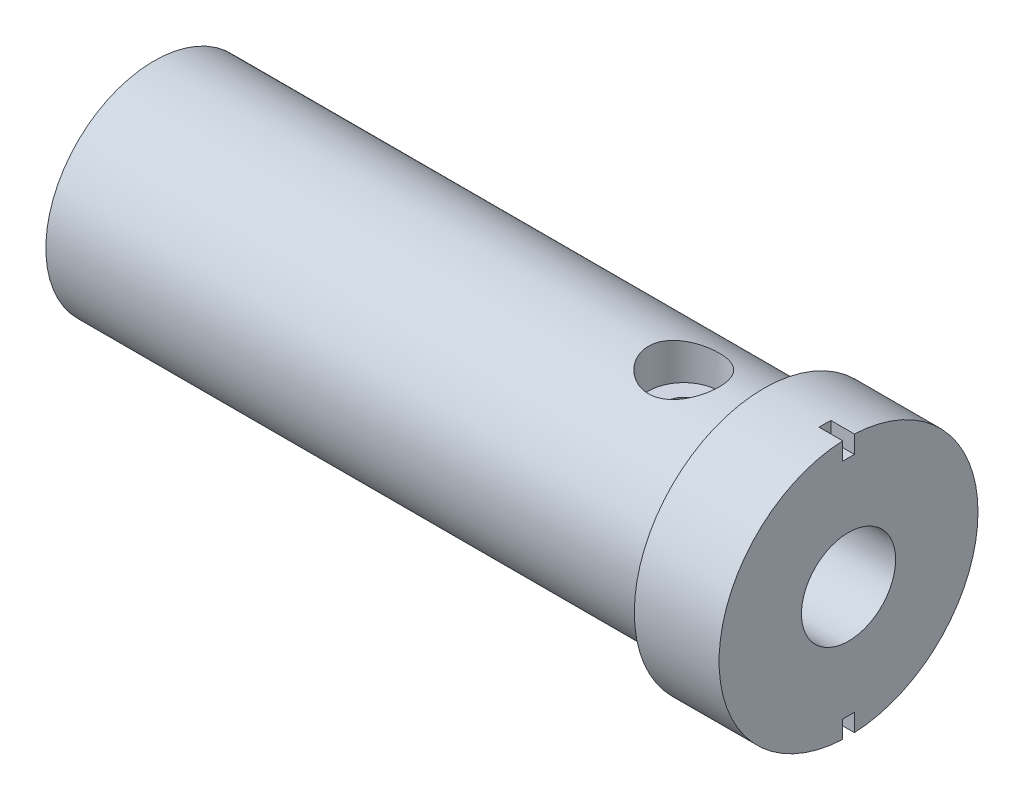
ISO-10303-21;
HEADER;
FILE_DESCRIPTION(('STEP AP214'),'2;1');
FILE_NAME('part.step','',(''),(''),'','','');
FILE_SCHEMA(('AUTOMOTIVE_DESIGN { 1 0 10303 214 1 1 1 1 }'));
ENDSEC;
DATA;
#1=APPLICATION_CONTEXT('core data for automotive mechanical design processes');
#2=APPLICATION_PROTOCOL_DEFINITION('international standard','automotive_design',2000,#1);
#3=PRODUCT_CONTEXT('',#1,'mechanical');
#4=PRODUCT('Part','Part','',(#3));
#5=PRODUCT_RELATED_PRODUCT_CATEGORY('part','',(#4));
#6=PRODUCT_DEFINITION_FORMATION('','',#4);
#7=PRODUCT_DEFINITION_CONTEXT('part definition',#1,'design');
#8=PRODUCT_DEFINITION('design','',#6,#7);
#9=PRODUCT_DEFINITION_SHAPE('','',#8);
#10=(LENGTH_UNIT() NAMED_UNIT(*) SI_UNIT(.MILLI.,.METRE.));
#11=(NAMED_UNIT(*) PLANE_ANGLE_UNIT() SI_UNIT($,.RADIAN.));
#12=(NAMED_UNIT(*) SI_UNIT($,.STERADIAN.) SOLID_ANGLE_UNIT());
#13=UNCERTAINTY_MEASURE_WITH_UNIT(LENGTH_MEASURE(1.E-05),#10,'distance_accuracy_value','');
#14=(GEOMETRIC_REPRESENTATION_CONTEXT(3) GLOBAL_UNCERTAINTY_ASSIGNED_CONTEXT((#13)) GLOBAL_UNIT_ASSIGNED_CONTEXT((#10,
#11,#12)) REPRESENTATION_CONTEXT('',''));
#15=CARTESIAN_POINT('',(0.,0.,0.));
#16=DIRECTION('',(0.,0.,1.));
#17=DIRECTION('',(1.,0.,0.));
#18=AXIS2_PLACEMENT_3D('',#15,#16,#17);
#19=CARTESIAN_POINT('',(0.,0.,0.));
#20=DIRECTION('',(1.,0.,0.));
#21=DIRECTION('',(0.,0.,-1.));
#22=AXIS2_PLACEMENT_3D('',#19,#20,#21);
#23=PLANE('',#22);
#24=CARTESIAN_POINT('',(0.,0.,0.));
#25=DIRECTION('',(1.,0.,0.));
#26=DIRECTION('',(0.,0.,-1.));
#27=AXIS2_PLACEMENT_3D('',#24,#25,#26);
#28=CIRCLE('',#27,4.);
#29=CARTESIAN_POINT('',(0.,0.,-4.));
#30=VERTEX_POINT('',#29);
#31=EDGE_CURVE('E209',#30,#30,#28,.T.);
#32=ORIENTED_EDGE('',*,*,#31,.F.);
#33=EDGE_LOOP('',(#32));
#34=FACE_BOUND('',#33,.T.);
#35=DIRECTION('',(0.,0.,1.));
#36=VECTOR('',#35,1.);
#37=CARTESIAN_POINT('',(0.,9.48863048791795,0.));
#38=LINE('',#37,#36);
#39=CARTESIAN_POINT('',(0.,9.48863048791795,-0.499999999999999));
#40=VERTEX_POINT('',#39);
#41=CARTESIAN_POINT('',(0.,9.48863048791795,0.500000000000001));
#42=VERTEX_POINT('',#41);
#43=EDGE_CURVE('E140',#40,#42,#38,.T.);
#44=ORIENTED_EDGE('',*,*,#43,.T.);
#45=DIRECTION('',(0.,1.,0.));
#46=VECTOR('',#45,1.);
#47=CARTESIAN_POINT('',(0.,0.,0.500000000000001));
#48=LINE('',#47,#46);
#49=CARTESIAN_POINT('',(0.,10.988630487918,0.500000000000001));
#50=VERTEX_POINT('',#49);
#51=EDGE_CURVE('E127',#42,#50,#48,.T.);
#52=ORIENTED_EDGE('',*,*,#51,.T.);
#53=CARTESIAN_POINT('',(0.,0.,0.));
#54=DIRECTION('',(1.,0.,0.));
#55=DIRECTION('',(0.,0.,-1.));
#56=AXIS2_PLACEMENT_3D('',#53,#54,#55);
#57=CIRCLE('',#56,11.);
#58=CARTESIAN_POINT('',(0.,-10.988630487918,0.500000000000001));
#59=VERTEX_POINT('',#58);
#60=EDGE_CURVE('E11',#50,#59,#57,.T.);
#61=ORIENTED_EDGE('',*,*,#60,.T.);
#62=DIRECTION('',(0.,-1.,0.));
#63=VECTOR('',#62,1.);
#64=CARTESIAN_POINT('',(0.,0.,0.500000000000001));
#65=LINE('',#64,#63);
#66=CARTESIAN_POINT('',(0.,-9.48863048791795,0.500000000000001));
#67=VERTEX_POINT('',#66);
#68=EDGE_CURVE('E166',#67,#59,#65,.T.);
#69=ORIENTED_EDGE('',*,*,#68,.F.);
#70=DIRECTION('',(0.,0.,1.));
#71=VECTOR('',#70,1.);
#72=CARTESIAN_POINT('',(0.,-9.48863048791795,0.));
#73=LINE('',#72,#71);
#74=CARTESIAN_POINT('',(0.,-9.48863048791795,-0.499999999999999));
#75=VERTEX_POINT('',#74);
#76=EDGE_CURVE('E180',#75,#67,#73,.T.);
#77=ORIENTED_EDGE('',*,*,#76,.F.);
#78=DIRECTION('',(0.,1.,0.));
#79=VECTOR('',#78,1.);
#80=CARTESIAN_POINT('',(0.,0.,-0.5));
#81=LINE('',#80,#79);
#82=CARTESIAN_POINT('',(0.,-10.988630487918,-0.499999999999999));
#83=VERTEX_POINT('',#82);
#84=EDGE_CURVE('E176',#83,#75,#81,.T.);
#85=ORIENTED_EDGE('',*,*,#84,.F.);
#86=CARTESIAN_POINT('',(0.,10.988630487918,-0.499999999999999));
#87=VERTEX_POINT('',#86);
#88=EDGE_CURVE('E53',#83,#87,#57,.T.);
#89=ORIENTED_EDGE('',*,*,#88,.T.);
#90=DIRECTION('',(0.,-1.,0.));
#91=VECTOR('',#90,1.);
#92=CARTESIAN_POINT('',(0.,0.,-0.5));
#93=LINE('',#92,#91);
#94=EDGE_CURVE('E136',#87,#40,#93,.T.);
#95=ORIENTED_EDGE('',*,*,#94,.T.);
#96=EDGE_LOOP('',(#44,#52,#61,#69,#77,#85,#89,#95));
#97=FACE_BOUND('',#96,.T.);
#98=ADVANCED_FACE('F39',(#34,#97),#23,.T.);
#99=CARTESIAN_POINT('',(0.,0.,0.));
#100=DIRECTION('',(1.,0.,0.));
#101=DIRECTION('',(0.,0.,-1.));
#102=AXIS2_PLACEMENT_3D('',#99,#100,#101);
#103=CYLINDRICAL_SURFACE('',#102,11.);
#104=CARTESIAN_POINT('',(-7.2,0.,0.));
#105=DIRECTION('',(1.,0.,0.));
#106=DIRECTION('',(0.,0.,-1.));
#107=AXIS2_PLACEMENT_3D('',#104,#105,#106);
#108=CIRCLE('',#107,11.);
#109=CARTESIAN_POINT('',(-7.2,0.,-11.));
#110=VERTEX_POINT('',#109);
#111=EDGE_CURVE('E221',#110,#110,#108,.T.);
#112=ORIENTED_EDGE('',*,*,#111,.T.);
#113=EDGE_LOOP('',(#112));
#114=FACE_BOUND('',#113,.T.);
#115=ORIENTED_EDGE('',*,*,#60,.F.);
#116=DIRECTION('',(1.,0.,0.));
#117=VECTOR('',#116,1.);
#118=CARTESIAN_POINT('',(-2.,10.988630487918,0.500000000000001));
#119=LINE('',#118,#117);
#120=CARTESIAN_POINT('',(-2.,10.988630487918,0.500000000000001));
#121=VERTEX_POINT('',#120);
#122=EDGE_CURVE('E152',#121,#50,#119,.T.);
#123=ORIENTED_EDGE('',*,*,#122,.F.);
#124=CARTESIAN_POINT('',(-2.,0.,0.));
#125=DIRECTION('',(1.,0.,0.));
#126=DIRECTION('',(0.,0.,-1.));
#127=AXIS2_PLACEMENT_3D('',#124,#125,#126);
#128=CIRCLE('',#127,11.);
#129=CARTESIAN_POINT('',(-2.,10.988630487918,-0.499999999999999));
#130=VERTEX_POINT('',#129);
#131=EDGE_CURVE('E130',#130,#121,#128,.T.);
#132=ORIENTED_EDGE('',*,*,#131,.F.);
#133=DIRECTION('',(1.,0.,0.));
#134=VECTOR('',#133,1.);
#135=CARTESIAN_POINT('',(-2.,10.988630487918,-0.499999999999999));
#136=LINE('',#135,#134);
#137=EDGE_CURVE('E156',#130,#87,#136,.T.);
#138=ORIENTED_EDGE('',*,*,#137,.T.);
#139=ORIENTED_EDGE('',*,*,#88,.F.);
#140=DIRECTION('',(1.,0.,0.));
#141=VECTOR('',#140,1.);
#142=CARTESIAN_POINT('',(-2.,-10.988630487918,-0.499999999999999));
#143=LINE('',#142,#141);
#144=CARTESIAN_POINT('',(-2.,-10.988630487918,-0.499999999999999));
#145=VERTEX_POINT('',#144);
#146=EDGE_CURVE('E175',#145,#83,#143,.T.);
#147=ORIENTED_EDGE('',*,*,#146,.F.);
#148=CARTESIAN_POINT('',(-2.,0.,0.));
#149=DIRECTION('',(1.,0.,0.));
#150=DIRECTION('',(0.,0.,-1.));
#151=AXIS2_PLACEMENT_3D('',#148,#149,#150);
#152=CIRCLE('',#151,11.);
#153=CARTESIAN_POINT('',(-2.,-10.988630487918,0.500000000000001));
#154=VERTEX_POINT('',#153);
#155=EDGE_CURVE('E162',#154,#145,#152,.T.);
#156=ORIENTED_EDGE('',*,*,#155,.F.);
#157=DIRECTION('',(1.,0.,0.));
#158=VECTOR('',#157,1.);
#159=CARTESIAN_POINT('',(-2.,-10.988630487918,0.500000000000001));
#160=LINE('',#159,#158);
#161=EDGE_CURVE('E149',#154,#59,#160,.T.);
#162=ORIENTED_EDGE('',*,*,#161,.T.);
#163=EDGE_LOOP('',(#115,#123,#132,#138,#139,#147,#156,#162));
#164=FACE_BOUND('',#163,.T.);
#165=ADVANCED_FACE('F258',(#114,#164),#103,.T.);
#166=CARTESIAN_POINT('',(0.,0.,0.));
#167=DIRECTION('',(1.,0.,0.));
#168=DIRECTION('',(0.,0.,-1.));
#169=AXIS2_PLACEMENT_3D('',#166,#167,#168);
#170=CYLINDRICAL_SURFACE('',#169,9.19999999999999);
#171=CARTESIAN_POINT('',(-59.,0.,0.));
#172=DIRECTION('',(1.,0.,0.));
#173=DIRECTION('',(0.,0.,-1.));
#174=AXIS2_PLACEMENT_3D('',#171,#172,#173);
#175=CIRCLE('',#174,9.19999999999999);
#176=CARTESIAN_POINT('',(-59.,0.,-9.19999999999999));
#177=VERTEX_POINT('',#176);
#178=EDGE_CURVE('E208',#177,#177,#175,.T.);
#179=ORIENTED_EDGE('',*,*,#178,.T.);
#180=EDGE_LOOP('',(#179));
#181=FACE_BOUND('',#180,.T.);
#182=CARTESIAN_POINT('',(-7.2,0.,0.));
#183=DIRECTION('',(1.,0.,0.));
#184=DIRECTION('',(0.,0.,-1.));
#185=AXIS2_PLACEMENT_3D('',#182,#183,#184);
#186=CIRCLE('',#185,9.2);
#187=CARTESIAN_POINT('',(-7.2,0.,-9.2));
#188=VERTEX_POINT('',#187);
#189=EDGE_CURVE('E217',#188,#188,#186,.T.);
#190=ORIENTED_EDGE('',*,*,#189,.F.);
#191=EDGE_LOOP('',(#190));
#192=FACE_BOUND('',#191,.T.);
#193=CARTESIAN_POINT('',(-14.,8.69712596206355,-3.));
#194=CARTESIAN_POINT('',(-13.8363719641745,8.69712602561283,-3.00000006948843));
#195=CARTESIAN_POINT('',(-13.6727429048873,8.70179420906425,-2.98656760005086));
#196=CARTESIAN_POINT('',(-13.3503181658293,8.7198707417757,-2.93336401551207));
#197=CARTESIAN_POINT('',(-13.1915234649716,8.73328084903519,-2.89358760262237));
#198=CARTESIAN_POINT('',(-12.8834880523258,8.76716430876784,-2.78923030719512));
#199=CARTESIAN_POINT('',(-12.7342298865561,8.78762429226838,-2.72469634734532));
#200=CARTESIAN_POINT('',(-12.4486127853286,8.83328304536185,-2.57281482250125));
#201=CARTESIAN_POINT('',(-12.3122565089369,8.85848278863063,-2.48546256857121));
#202=CARTESIAN_POINT('',(-12.0512103195749,8.91183948555475,-2.28692219691646));
#203=CARTESIAN_POINT('',(-11.9270739443255,8.94006780908053,-2.17502527730267));
#204=CARTESIAN_POINT('',(-11.6989534102711,8.99569637021582,-1.93208603100607));
#205=CARTESIAN_POINT('',(-11.5949723333283,9.02309648064696,-1.80104078179666));
#206=CARTESIAN_POINT('',(-11.4076269513869,9.07480417137145,-1.51950174610697));
#207=CARTESIAN_POINT('',(-11.3248391108413,9.09901799471419,-1.36860562348148));
#208=CARTESIAN_POINT('',(-11.1860378336906,9.14078660779368,-1.05410527392676));
#209=CARTESIAN_POINT('',(-11.1300175104857,9.15834311004923,-0.890504328230099));
#210=CARTESIAN_POINT('',(-11.0482083321482,9.18431353905578,-0.561039311526711));
#211=CARTESIAN_POINT('',(-11.021471989602,9.19301331783793,-0.395433460298393));
#212=CARTESIAN_POINT('',(-10.9959808228424,9.2013029471673,-0.0618729536399165));
#213=CARTESIAN_POINT('',(-10.9972190892016,9.20089504721341,0.106081111564884));
#214=CARTESIAN_POINT('',(-11.0270330949521,9.19121087856134,0.432877467383254));
#215=CARTESIAN_POINT('',(-11.0545804301941,9.18226823639605,0.591825072105989));
#216=CARTESIAN_POINT('',(-11.1345346363526,9.15693522813862,0.902703713535023));
#217=CARTESIAN_POINT('',(-11.1869431720646,9.1405443632898,1.0546342796074));
#218=CARTESIAN_POINT('',(-11.3157536765466,9.10172363407732,1.34945857551705));
#219=CARTESIAN_POINT('',(-11.3924551290893,9.07921891922917,1.49221119656913));
#220=CARTESIAN_POINT('',(-11.5674297774354,9.03052321490297,1.76312900882243));
#221=CARTESIAN_POINT('',(-11.6657087859708,9.00433123280328,1.89129025512961));
#222=CARTESIAN_POINT('',(-11.8862660672858,8.94963510368291,2.13551054636341));
#223=CARTESIAN_POINT('',(-12.0094279326935,8.92107995667196,2.25076133825675));
#224=CARTESIAN_POINT('',(-12.2735830226485,8.86588177281267,2.45922724376976));
#225=CARTESIAN_POINT('',(-12.4145787506148,8.8392390052382,2.55243925842673));
#226=CARTESIAN_POINT('',(-12.7128614559887,8.79061060372585,2.71523620605493));
#227=CARTESIAN_POINT('',(-12.870337954798,8.76869067896904,2.78449500230246));
#228=CARTESIAN_POINT('',(-13.1956103201195,8.73275371918737,2.89524477566101));
#229=CARTESIAN_POINT('',(-13.3634020543878,8.71873354214059,2.93674679389927));
#230=CARTESIAN_POINT('',(-13.6967425583219,8.70088969109624,2.98919004884247));
#231=CARTESIAN_POINT('',(-13.862072827101,8.69665004268403,3.00137901368447));
#232=CARTESIAN_POINT('',(-14.1924368298021,8.69768729156416,2.99837337293999));
#233=CARTESIAN_POINT('',(-14.3574706097813,8.70296255434456,2.98318347061216));
#234=CARTESIAN_POINT('',(-14.6769901426862,8.72202193994362,2.92697036189824));
#235=CARTESIAN_POINT('',(-14.8316444085104,8.73552500390931,2.88679959741978));
#236=CARTESIAN_POINT('',(-15.131991490569,8.76921338217084,2.78278011008459));
#237=CARTESIAN_POINT('',(-15.2776827568995,8.7893998483471,2.71892730541411));
#238=CARTESIAN_POINT('',(-15.5609171482622,8.83494779646293,2.56712739933201));
#239=CARTESIAN_POINT('',(-15.6980733808423,8.8604489949994,2.47850145430636));
#240=CARTESIAN_POINT('',(-15.9560195986291,8.91347559935073,2.28044848294344));
#241=CARTESIAN_POINT('',(-16.076804943858,8.94100157564942,2.17101558034839));
#242=CARTESIAN_POINT('',(-16.3042846156628,8.99649879773837,1.92850982824102));
#243=CARTESIAN_POINT('',(-16.4100821980691,9.02443286130206,1.79458489750842));
#244=CARTESIAN_POINT('',(-16.5977520889612,9.07635176949049,1.51019887066399));
#245=CARTESIAN_POINT('',(-16.6796253470579,9.10033677084598,1.35973843121036));
#246=CARTESIAN_POINT('',(-16.8163567816146,9.1415331876694,1.04737228527324));
#247=CARTESIAN_POINT('',(-16.8713990904744,9.15879060371627,0.885553564855848));
#248=CARTESIAN_POINT('',(-16.9532777416875,9.18478757011083,0.554286640438635));
#249=CARTESIAN_POINT('',(-16.9801237806073,9.19353004863087,0.384841080192691));
#250=CARTESIAN_POINT('',(-17.0040048323584,9.20130058724371,0.0513507308213625));
#251=CARTESIAN_POINT('',(-17.0023298846796,9.20074903984763,-0.112592918733417));
#252=CARTESIAN_POINT('',(-16.9723765689864,9.19101860788011,-0.437754965054961));
#253=CARTESIAN_POINT('',(-16.9441002048655,9.18184037315992,-0.598973566169311));
#254=CARTESIAN_POINT('',(-16.8625910848386,9.1560347195712,-0.911768497880307));
#255=CARTESIAN_POINT('',(-16.8097299077098,9.13951837084227,-1.06345146731181));
#256=CARTESIAN_POINT('',(-16.6808924735539,9.1007374974658,-1.35585956495554));
#257=CARTESIAN_POINT('',(-16.6049121016948,9.07847194966336,-1.4965827369017));
#258=CARTESIAN_POINT('',(-16.428845635717,9.02950168220742,-1.76858430385069));
#259=CARTESIAN_POINT('',(-16.3279916296062,9.00266622521187,-1.8993418037466));
#260=CARTESIAN_POINT('',(-16.1063638529174,8.94791896179727,-2.14250077887531));
#261=CARTESIAN_POINT('',(-15.9855838665481,8.92000682160158,-2.25489650441818));
#262=CARTESIAN_POINT('',(-15.7221861911371,8.86503012273927,-2.46235668401022));
#263=CARTESIAN_POINT('',(-15.5789260098108,8.8380351013346,-2.55662631922266));
#264=CARTESIAN_POINT('',(-15.2777649555458,8.78923590884106,-2.71967131657978));
#265=CARTESIAN_POINT('',(-15.1198686935222,8.76743011062269,-2.78845467396348));
#266=CARTESIAN_POINT('',(-14.8035183632355,8.73283625684646,-2.89491464128439));
#267=CARTESIAN_POINT('',(-14.6456553983462,8.71958920178867,-2.93419731407699));
#268=CARTESIAN_POINT('',(-14.3251943123412,8.70173534997871,-2.98673596114189));
#269=CARTESIAN_POINT('',(-14.1625976614769,8.69712589891445,-2.99999993094914));
#270=CARTESIAN_POINT('',(-14.,8.69712596206355,-3.));
#271=B_SPLINE_CURVE_WITH_KNOTS('',3,(#193,#194,#195,#196,#197,#198,#199,#200,#201,#202,#203,
#204,#205,#206,#207,#208,#209,#210,#211,#212,#213,#214,#215,#216,#217,#218,#219,#220,#221,#222,
#223,#224,#225,#226,#227,#228,#229,#230,#231,#232,#233,#234,#235,#236,#237,#238,#239,#240,#241,
#242,#243,#244,#245,#246,#247,#248,#249,#250,#251,#252,#253,#254,#255,#256,#257,#258,#259,#260,
#261,#262,#263,#264,#265,#266,#267,#268,#269,#270),.UNSPECIFIED.,.T.,.F.,(4,2,2,2,2,2,2,2,2,2,2,
2,2,2,2,2,2,2,2,2,2,2,2,2,2,2,2,2,2,2,2,2,2,2,2,2,2,2,4),(0.,0.490282515204811,
0.980663656572736,1.47011993962961,1.9596768803839,2.46586129965626,2.97212305651692,
3.49096398502884,4.00967135703011,4.51104899920583,5.01230280785483,5.49473204934623,
5.97719360059669,6.46585099045064,6.95464018055548,7.46551015601591,7.97645192433021,
8.49409929484987,9.0115406322624,9.50653342702692,10.0014411979209,10.480323237867,
10.9592878558497,11.4529407663323,11.9467333008874,12.4631024813133,12.9794511630884,
13.4922045912555,14.0047816281003,14.4942383091859,14.9836581222892,15.4659098542283,
15.9482474692103,16.4479124063776,16.9477335068034,17.4660419863822,17.9841877307132,
18.4715326954798,18.9587278758968),.UNSPECIFIED.);
#272=CARTESIAN_POINT('',(-14.,8.69712596206355,-3.));
#273=VERTEX_POINT('',#272);
#274=EDGE_CURVE('E42',#273,#273,#271,.T.);
#275=ORIENTED_EDGE('',*,*,#274,.T.);
#276=EDGE_LOOP('',(#275));
#277=FACE_BOUND('',#276,.T.);
#278=ADVANCED_FACE('F240',(#181,#192,#277),#170,.T.);
#279=CARTESIAN_POINT('',(-14.,11.,0.));
#280=DIRECTION('',(0.,-1.,0.));
#281=DIRECTION('',(0.,0.,-1.));
#282=AXIS2_PLACEMENT_3D('',#279,#280,#281);
#283=CYLINDRICAL_SURFACE('',#282,1.475);
#284=CARTESIAN_POINT('',(-14.,3.71811444148778,-1.475));
#285=CARTESIAN_POINT('',(-13.9202345126051,3.71811213565653,-1.47500252199431));
#286=CARTESIAN_POINT('',(-13.840485972295,3.72070918325006,-1.46850804774699));
#287=CARTESIAN_POINT('',(-13.683386854708,3.73074685662595,-1.44281517636158));
#288=CARTESIAN_POINT('',(-13.6060362700037,3.73818746740454,-1.42361681857595));
#289=CARTESIAN_POINT('',(-13.4560433614095,3.75695727071103,-1.37331103095944));
#290=CARTESIAN_POINT('',(-13.3833905449009,3.76827741450174,-1.34223129429865));
#291=CARTESIAN_POINT('',(-13.2443025361921,3.793516438564,-1.26914262044474));
#292=CARTESIAN_POINT('',(-13.1778691511946,3.80743607068124,-1.22713051991561));
#293=CARTESIAN_POINT('',(-13.0499150861579,3.83705483289747,-1.13120849927479));
#294=CARTESIAN_POINT('',(-12.9887355615843,3.85280512400773,-1.07685917926158));
#295=CARTESIAN_POINT('',(-12.8761200610122,3.88388289544258,-0.958738641596155));
#296=CARTESIAN_POINT('',(-12.8246860763635,3.89921028880911,-0.894965503061199));
#297=CARTESIAN_POINT('',(-12.7313934664519,3.92832092352489,-0.75723295228631));
#298=CARTESIAN_POINT('',(-12.6899035773273,3.9420371588446,-0.683008350957839));
#299=CARTESIAN_POINT('',(-12.6201398477416,3.96576698519546,-0.528038150759536));
#300=CARTESIAN_POINT('',(-12.591861586617,3.97578181449718,-0.44729474372909));
#301=CARTESIAN_POINT('',(-12.5505140879478,3.99061738241784,-0.285164132019118));
#302=CARTESIAN_POINT('',(-12.5368579712354,3.99563792257159,-0.203945233479788));
#303=CARTESIAN_POINT('',(-12.5232642223347,4.00063505418094,-0.0402237373594162));
#304=CARTESIAN_POINT('',(-12.5233222761699,4.00061323177942,0.0422784483807962));
#305=CARTESIAN_POINT('',(-12.5368086481374,3.99565650156055,0.20202631897613));
#306=CARTESIAN_POINT('',(-12.5495968951372,3.99095679770598,0.279334594774485));
#307=CARTESIAN_POINT('',(-12.5871068145997,3.97747878568365,0.430619174443247));
#308=CARTESIAN_POINT('',(-12.6118293285672,3.96870018990811,0.504595242951995));
#309=CARTESIAN_POINT('',(-12.6728148606985,3.94777990511235,0.648376624059889));
#310=CARTESIAN_POINT('',(-12.7092387269631,3.93559166782433,0.718106659508759));
#311=CARTESIAN_POINT('',(-12.7924523568196,3.9090910818338,0.850635690887643));
#312=CARTESIAN_POINT('',(-12.8392454019834,3.89477806116774,0.913432483181793));
#313=CARTESIAN_POINT('',(-12.9449757697818,3.86454977015343,1.03408995883905));
#314=CARTESIAN_POINT('',(-13.004451599598,3.84858966817658,1.09146824284382));
#315=CARTESIAN_POINT('',(-13.1322840941606,3.81752107182053,1.19561420556987));
#316=CARTESIAN_POINT('',(-13.2006428340698,3.8024127776209,1.24237939790252));
#317=CARTESIAN_POINT('',(-13.3461443504252,3.77448142603862,1.32485166443115));
#318=CARTESIAN_POINT('',(-13.4234405002808,3.7617125559201,1.36030797120532));
#319=CARTESIAN_POINT('',(-13.5835007713566,3.74053148462746,1.41752110407297));
#320=CARTESIAN_POINT('',(-13.6662619443922,3.73211695574566,1.43928525095316));
#321=CARTESIAN_POINT('',(-13.8301490650295,3.72114283180293,1.46741718483658));
#322=CARTESIAN_POINT('',(-13.911124396005,3.71829324830066,1.4745485822466));
#323=CARTESIAN_POINT('',(-14.0731471763952,3.71795226813902,1.47540948834896));
#324=CARTESIAN_POINT('',(-14.1541946040334,3.72045959516115,1.46914218936695));
#325=CARTESIAN_POINT('',(-14.3102166390058,3.73025621606116,1.44407511912156));
#326=CARTESIAN_POINT('',(-14.3853000346173,3.73732376577703,1.4258558666314));
#327=CARTESIAN_POINT('',(-14.5313130250406,3.7551844594644,1.37812710408421));
#328=CARTESIAN_POINT('',(-14.6022417826792,3.76597835130609,1.34861532750884));
#329=CARTESIAN_POINT('',(-14.740822315664,3.79056283087991,1.27791979752024));
#330=CARTESIAN_POINT('',(-14.8082586233717,3.80444877314845,1.23634780256965));
#331=CARTESIAN_POINT('',(-14.9354701400384,3.83348877536074,1.14312903123162));
#332=CARTESIAN_POINT('',(-14.9952426136907,3.84864328489808,1.09147867426079));
#333=CARTESIAN_POINT('',(-15.1092055986854,3.87962892056577,0.975843370136464));
#334=CARTESIAN_POINT('',(-15.1628340987776,3.89544501244442,0.911298626974176));
#335=CARTESIAN_POINT('',(-15.2585612451219,3.92508280935524,0.773736858886338));
#336=CARTESIAN_POINT('',(-15.3006599417041,3.93890452309318,0.700719870945945));
#337=CARTESIAN_POINT('',(-15.3718324865705,3.96297599932408,0.548393561678376));
#338=CARTESIAN_POINT('',(-15.4009590446393,3.97324017872539,0.469111274804157));
#339=CARTESIAN_POINT('',(-15.4453056437974,3.98909130667972,0.306309469162703));
#340=CARTESIAN_POINT('',(-15.460531977424,3.99468037152937,0.222791885777731));
#341=CARTESIAN_POINT('',(-15.4759842948138,4.00035729797106,0.0589788612318041));
#342=CARTESIAN_POINT('',(-15.4770099163648,4.00073840144692,-0.0212316827022015));
#343=CARTESIAN_POINT('',(-15.4660753764268,3.99671438308603,-0.180632033098355));
#344=CARTESIAN_POINT('',(-15.4541166946628,3.99230980663778,-0.259821954832678));
#345=CARTESIAN_POINT('',(-15.4181108290431,3.9793393706644,-0.413091274619788));
#346=CARTESIAN_POINT('',(-15.3943475155363,3.97087138101943,-0.487246266064744));
#347=CARTESIAN_POINT('',(-15.3356861414604,3.95065522499206,-0.630526623625091));
#348=CARTESIAN_POINT('',(-15.3007859774803,3.9389064390198,-0.69965103658663));
#349=CARTESIAN_POINT('',(-15.2191954349324,3.91270511990517,-0.834038593944479));
#350=CARTESIAN_POINT('',(-15.1720769563989,3.898160826978,-0.899023617903026));
#351=CARTESIAN_POINT('',(-15.068070179934,3.86816128804962,-1.02041401083609));
#352=CARTESIAN_POINT('',(-15.0111784436397,3.85270572271171,-1.07681634709181));
#353=CARTESIAN_POINT('',(-14.8858134556283,3.82167177537087,-1.18237328477067));
#354=CARTESIAN_POINT('',(-14.8168997708888,3.80612676839609,-1.2310165810729));
#355=CARTESIAN_POINT('',(-14.6713838054388,3.77757206560537,-1.31604289925926));
#356=CARTESIAN_POINT('',(-14.5947812095536,3.76456247378251,-1.35242541829754));
#357=CARTESIAN_POINT('',(-14.4335457600886,3.74243106136043,-1.41254286309879));
#358=CARTESIAN_POINT('',(-14.3487420822731,3.73343604397724,-1.43587050505717));
#359=CARTESIAN_POINT('',(-14.1759507711393,3.72128075575353,-1.46709305335709));
#360=CARTESIAN_POINT('',(-14.08796508039,3.71811698434984,-1.47499721875413));
#361=CARTESIAN_POINT('',(-14.,3.71811444148778,-1.475));
#362=B_SPLINE_CURVE_WITH_KNOTS('',3,(#284,#285,#286,#287,#288,#289,#290,#291,#292,#293,#294,
#295,#296,#297,#298,#299,#300,#301,#302,#303,#304,#305,#306,#307,#308,#309,#310,#311,#312,#313,
#314,#315,#316,#317,#318,#319,#320,#321,#322,#323,#324,#325,#326,#327,#328,#329,#330,#331,#332,
#333,#334,#335,#336,#337,#338,#339,#340,#341,#342,#343,#344,#345,#346,#347,#348,#349,#350,#351,
#352,#353,#354,#355,#356,#357,#358,#359,#360,#361),.UNSPECIFIED.,.T.,.F.,(4,2,2,2,2,2,2,2,2,2,2,
2,2,2,2,2,2,2,2,2,2,2,2,2,2,2,2,2,2,2,2,2,2,2,2,2,2,2,4),(0.,0.238969181810635,
0.477937623376773,0.71635243911806,0.954836318278162,1.20373311013185,1.45268070546066,
1.70978089132938,1.9667949887284,2.21305487306768,2.45923729315766,2.6936367359991,
2.92805270914773,3.16583975457612,3.40370216108591,3.65506393313976,3.90648453247798,
4.16314485027735,4.41966782262403,4.6624236250086,4.90512159570665,5.13682652071959,
5.36857797555689,5.60882566745091,5.84915886910428,6.10413555547834,6.35911112880641,
6.61304098887209,6.86685583952638,7.10631630708974,7.34574948797949,7.57968501432373,
7.81366475012415,8.05732605723101,8.30107326386441,8.5571570789309,8.81325139537211,
9.07694406229741,9.34047837989814),.UNSPECIFIED.);
#363=CARTESIAN_POINT('',(-14.,3.71811444148778,-1.475));
#364=VERTEX_POINT('',#363);
#365=EDGE_CURVE('E213',#364,#364,#362,.T.);
#366=ORIENTED_EDGE('',*,*,#365,.T.);
#367=EDGE_LOOP('',(#366));
#368=FACE_BOUND('',#367,.T.);
#369=CARTESIAN_POINT('',(-14.,5.9,0.));
#370=DIRECTION('',(0.,1.,0.));
#371=DIRECTION('',(0.,0.,1.));
#372=AXIS2_PLACEMENT_3D('',#369,#370,#371);
#373=CIRCLE('',#372,1.475);
#374=CARTESIAN_POINT('',(-14.,5.9,1.475));
#375=VERTEX_POINT('',#374);
#376=EDGE_CURVE('E155',#375,#375,#373,.T.);
#377=ORIENTED_EDGE('',*,*,#376,.T.);
#378=EDGE_LOOP('',(#377));
#379=FACE_BOUND('',#378,.T.);
#380=ADVANCED_FACE('F237',(#368,#379),#283,.F.);
#381=CARTESIAN_POINT('',(-20.,0.,0.));
#382=DIRECTION('',(1.,0.,0.));
#383=DIRECTION('',(0.,0.,-1.));
#384=AXIS2_PLACEMENT_3D('',#381,#382,#383);
#385=CYLINDRICAL_SURFACE('',#384,4.);
#386=CARTESIAN_POINT('',(-20.,0.,0.));
#387=DIRECTION('',(1.,0.,0.));
#388=DIRECTION('',(0.,0.,-1.));
#389=AXIS2_PLACEMENT_3D('',#386,#387,#388);
#390=CIRCLE('',#389,4.);
#391=CARTESIAN_POINT('',(-20.,0.,-4.));
#392=VERTEX_POINT('',#391);
#393=EDGE_CURVE('E204',#392,#392,#390,.T.);
#394=ORIENTED_EDGE('',*,*,#393,.F.);
#395=EDGE_LOOP('',(#394));
#396=FACE_BOUND('',#395,.T.);
#397=ORIENTED_EDGE('',*,*,#31,.T.);
#398=EDGE_LOOP('',(#397));
#399=FACE_BOUND('',#398,.T.);
#400=ORIENTED_EDGE('',*,*,#365,.F.);
#401=EDGE_LOOP('',(#400));
#402=FACE_BOUND('',#401,.T.);
#403=ADVANCED_FACE('F233',(#396,#399,#402),#385,.F.);
#404=CARTESIAN_POINT('',(-7.2,0.,-11.));
#405=DIRECTION('',(-1.,0.,0.));
#406=DIRECTION('',(0.,0.,1.));
#407=AXIS2_PLACEMENT_3D('',#404,#405,#406);
#408=PLANE('',#407);
#409=ORIENTED_EDGE('',*,*,#189,.T.);
#410=EDGE_LOOP('',(#409));
#411=FACE_BOUND('',#410,.T.);
#412=ORIENTED_EDGE('',*,*,#111,.F.);
#413=EDGE_LOOP('',(#412));
#414=FACE_BOUND('',#413,.T.);
#415=ADVANCED_FACE('F255',(#411,#414),#408,.T.);
#416=CARTESIAN_POINT('',(-59.,0.,-9.19999999999999));
#417=DIRECTION('',(-1.,0.,0.));
#418=DIRECTION('',(0.,0.,1.));
#419=AXIS2_PLACEMENT_3D('',#416,#417,#418);
#420=PLANE('',#419);
#421=ORIENTED_EDGE('',*,*,#178,.F.);
#422=EDGE_LOOP('',(#421));
#423=FACE_BOUND('',#422,.T.);
#424=ADVANCED_FACE('F248',(#423),#420,.T.);
#425=CARTESIAN_POINT('',(-20.,0.,0.));
#426=DIRECTION('',(1.,0.,0.));
#427=DIRECTION('',(0.,0.,-1.));
#428=AXIS2_PLACEMENT_3D('',#425,#426,#427);
#429=PLANE('',#428);
#430=ORIENTED_EDGE('',*,*,#393,.T.);
#431=EDGE_LOOP('',(#430));
#432=FACE_BOUND('',#431,.T.);
#433=ADVANCED_FACE('F245',(#432),#429,.T.);
#434=CARTESIAN_POINT('',(-14.,5.9,0.));
#435=DIRECTION('',(0.,1.,0.));
#436=DIRECTION('',(0.,0.,1.));
#437=AXIS2_PLACEMENT_3D('',#434,#435,#436);
#438=PLANE('',#437);
#439=CARTESIAN_POINT('',(-14.,5.9,0.));
#440=DIRECTION('',(0.,1.,0.));
#441=DIRECTION('',(0.,0.,1.));
#442=AXIS2_PLACEMENT_3D('',#439,#440,#441);
#443=CIRCLE('',#442,3.);
#444=CARTESIAN_POINT('',(-14.,5.9,3.));
#445=VERTEX_POINT('',#444);
#446=EDGE_CURVE('E200',#445,#445,#443,.T.);
#447=ORIENTED_EDGE('',*,*,#446,.T.);
#448=EDGE_LOOP('',(#447));
#449=FACE_BOUND('',#448,.T.);
#450=ORIENTED_EDGE('',*,*,#376,.F.);
#451=EDGE_LOOP('',(#450));
#452=FACE_BOUND('',#451,.T.);
#453=ADVANCED_FACE('F247',(#449,#452),#438,.T.);
#454=CARTESIAN_POINT('',(-14.,11.,0.));
#455=DIRECTION('',(0.,-1.,0.));
#456=DIRECTION('',(0.,0.,-1.));
#457=AXIS2_PLACEMENT_3D('',#454,#455,#456);
#458=CYLINDRICAL_SURFACE('',#457,3.);
#459=ORIENTED_EDGE('',*,*,#274,.F.);
#460=EDGE_LOOP('',(#459));
#461=FACE_BOUND('',#460,.T.);
#462=ORIENTED_EDGE('',*,*,#446,.F.);
#463=EDGE_LOOP('',(#462));
#464=FACE_BOUND('',#463,.T.);
#465=ADVANCED_FACE('F242',(#461,#464),#458,.F.);
#466=CARTESIAN_POINT('',(-2.,0.,0.500000000000001));
#467=DIRECTION('',(0.,0.,1.));
#468=DIRECTION('',(1.,0.,0.));
#469=AXIS2_PLACEMENT_3D('',#466,#467,#468);
#470=PLANE('',#469);
#471=ORIENTED_EDGE('',*,*,#68,.T.);
#472=ORIENTED_EDGE('',*,*,#161,.F.);
#473=DIRECTION('',(0.,-1.,0.));
#474=VECTOR('',#473,1.);
#475=CARTESIAN_POINT('',(-2.,0.,0.500000000000001));
#476=LINE('',#475,#474);
#477=CARTESIAN_POINT('',(-2.,-9.48863048791795,0.500000000000001));
#478=VERTEX_POINT('',#477);
#479=EDGE_CURVE('E69',#478,#154,#476,.T.);
#480=ORIENTED_EDGE('',*,*,#479,.F.);
#481=DIRECTION('',(1.,0.,0.));
#482=VECTOR('',#481,1.);
#483=CARTESIAN_POINT('',(-2.,-9.48863048791795,0.500000000000001));
#484=LINE('',#483,#482);
#485=EDGE_CURVE('E189',#478,#67,#484,.T.);
#486=ORIENTED_EDGE('',*,*,#485,.T.);
#487=EDGE_LOOP('',(#471,#472,#480,#486));
#488=FACE_BOUND('',#487,.T.);
#489=ADVANCED_FACE('F277',(#488),#470,.F.);
#490=CARTESIAN_POINT('',(-2.,-9.48863048791795,0.));
#491=DIRECTION('',(0.,1.,0.));
#492=DIRECTION('',(0.,0.,1.));
#493=AXIS2_PLACEMENT_3D('',#490,#491,#492);
#494=PLANE('',#493);
#495=ORIENTED_EDGE('',*,*,#76,.T.);
#496=ORIENTED_EDGE('',*,*,#485,.F.);
#497=DIRECTION('',(0.,0.,1.));
#498=VECTOR('',#497,1.);
#499=CARTESIAN_POINT('',(-2.,-9.48863048791795,0.));
#500=LINE('',#499,#498);
#501=CARTESIAN_POINT('',(-2.,-9.48863048791795,-0.499999999999999));
#502=VERTEX_POINT('',#501);
#503=EDGE_CURVE('E170',#502,#478,#500,.T.);
#504=ORIENTED_EDGE('',*,*,#503,.F.);
#505=DIRECTION('',(1.,0.,0.));
#506=VECTOR('',#505,1.);
#507=CARTESIAN_POINT('',(-2.,-9.48863048791795,-0.499999999999999));
#508=LINE('',#507,#506);
#509=EDGE_CURVE('E192',#502,#75,#508,.T.);
#510=ORIENTED_EDGE('',*,*,#509,.T.);
#511=EDGE_LOOP('',(#495,#496,#504,#510));
#512=FACE_BOUND('',#511,.T.);
#513=ADVANCED_FACE('F280',(#512),#494,.F.);
#514=CARTESIAN_POINT('',(-2.,0.,-0.5));
#515=DIRECTION('',(0.,0.,-1.));
#516=DIRECTION('',(0.,1.,0.));
#517=AXIS2_PLACEMENT_3D('',#514,#515,#516);
#518=PLANE('',#517);
#519=ORIENTED_EDGE('',*,*,#84,.T.);
#520=ORIENTED_EDGE('',*,*,#509,.F.);
#521=DIRECTION('',(0.,1.,0.));
#522=VECTOR('',#521,1.);
#523=CARTESIAN_POINT('',(-2.,0.,-0.5));
#524=LINE('',#523,#522);
#525=EDGE_CURVE('E165',#145,#502,#524,.T.);
#526=ORIENTED_EDGE('',*,*,#525,.F.);
#527=ORIENTED_EDGE('',*,*,#146,.T.);
#528=EDGE_LOOP('',(#519,#520,#526,#527));
#529=FACE_BOUND('',#528,.T.);
#530=ADVANCED_FACE('F282',(#529),#518,.F.);
#531=CARTESIAN_POINT('',(-2.,0.,0.));
#532=DIRECTION('',(1.,0.,0.));
#533=DIRECTION('',(0.,0.,-1.));
#534=AXIS2_PLACEMENT_3D('',#531,#532,#533);
#535=PLANE('',#534);
#536=ORIENTED_EDGE('',*,*,#155,.T.);
#537=ORIENTED_EDGE('',*,*,#525,.T.);
#538=ORIENTED_EDGE('',*,*,#503,.T.);
#539=ORIENTED_EDGE('',*,*,#479,.T.);
#540=EDGE_LOOP('',(#536,#537,#538,#539));
#541=FACE_BOUND('',#540,.T.);
#542=ADVANCED_FACE('F283',(#541),#535,.T.);
#543=CARTESIAN_POINT('',(-2.,0.,0.500000000000001));
#544=DIRECTION('',(0.,0.,-1.));
#545=DIRECTION('',(-1.,0.,0.));
#546=AXIS2_PLACEMENT_3D('',#543,#544,#545);
#547=PLANE('',#546);
#548=ORIENTED_EDGE('',*,*,#51,.F.);
#549=DIRECTION('',(1.,0.,0.));
#550=VECTOR('',#549,1.);
#551=CARTESIAN_POINT('',(-2.,9.48863048791795,0.500000000000001));
#552=LINE('',#551,#550);
#553=CARTESIAN_POINT('',(-2.,9.48863048791795,0.500000000000001));
#554=VERTEX_POINT('',#553);
#555=EDGE_CURVE('E117',#554,#42,#552,.T.);
#556=ORIENTED_EDGE('',*,*,#555,.F.);
#557=DIRECTION('',(0.,1.,0.));
#558=VECTOR('',#557,1.);
#559=CARTESIAN_POINT('',(-2.,0.,0.500000000000001));
#560=LINE('',#559,#558);
#561=EDGE_CURVE('E122',#554,#121,#560,.T.);
#562=ORIENTED_EDGE('',*,*,#561,.T.);
#563=ORIENTED_EDGE('',*,*,#122,.T.);
#564=EDGE_LOOP('',(#548,#556,#562,#563));
#565=FACE_BOUND('',#564,.T.);
#566=ADVANCED_FACE('F125',(#565),#547,.T.);
#567=CARTESIAN_POINT('',(-2.,0.,-0.5));
#568=DIRECTION('',(0.,0.,1.));
#569=DIRECTION('',(0.,-1.,0.));
#570=AXIS2_PLACEMENT_3D('',#567,#568,#569);
#571=PLANE('',#570);
#572=ORIENTED_EDGE('',*,*,#94,.F.);
#573=ORIENTED_EDGE('',*,*,#137,.F.);
#574=DIRECTION('',(0.,-1.,0.));
#575=VECTOR('',#574,1.);
#576=CARTESIAN_POINT('',(-2.,0.,-0.5));
#577=LINE('',#576,#575);
#578=CARTESIAN_POINT('',(-2.,9.48863048791795,-0.499999999999999));
#579=VERTEX_POINT('',#578);
#580=EDGE_CURVE('E61',#130,#579,#577,.T.);
#581=ORIENTED_EDGE('',*,*,#580,.T.);
#582=DIRECTION('',(1.,0.,0.));
#583=VECTOR('',#582,1.);
#584=CARTESIAN_POINT('',(-2.,9.48863048791795,-0.499999999999999));
#585=LINE('',#584,#583);
#586=EDGE_CURVE('E119',#579,#40,#585,.T.);
#587=ORIENTED_EDGE('',*,*,#586,.T.);
#588=EDGE_LOOP('',(#572,#573,#581,#587));
#589=FACE_BOUND('',#588,.T.);
#590=ADVANCED_FACE('F270',(#589),#571,.T.);
#591=CARTESIAN_POINT('',(-2.,9.48863048791795,0.));
#592=DIRECTION('',(0.,1.,0.));
#593=DIRECTION('',(0.,0.,1.));
#594=AXIS2_PLACEMENT_3D('',#591,#592,#593);
#595=PLANE('',#594);
#596=ORIENTED_EDGE('',*,*,#43,.F.);
#597=ORIENTED_EDGE('',*,*,#586,.F.);
#598=DIRECTION('',(0.,0.,1.));
#599=VECTOR('',#598,1.);
#600=CARTESIAN_POINT('',(-2.,9.48863048791795,0.));
#601=LINE('',#600,#599);
#602=EDGE_CURVE('E113',#579,#554,#601,.T.);
#603=ORIENTED_EDGE('',*,*,#602,.T.);
#604=ORIENTED_EDGE('',*,*,#555,.T.);
#605=EDGE_LOOP('',(#596,#597,#603,#604));
#606=FACE_BOUND('',#605,.T.);
#607=ADVANCED_FACE('F116',(#606),#595,.T.);
#608=CARTESIAN_POINT('',(-2.,0.,0.));
#609=DIRECTION('',(1.,0.,0.));
#610=DIRECTION('',(0.,0.,-1.));
#611=AXIS2_PLACEMENT_3D('',#608,#609,#610);
#612=PLANE('',#611);
#613=ORIENTED_EDGE('',*,*,#561,.F.);
#614=ORIENTED_EDGE('',*,*,#602,.F.);
#615=ORIENTED_EDGE('',*,*,#580,.F.);
#616=ORIENTED_EDGE('',*,*,#131,.T.);
#617=EDGE_LOOP('',(#613,#614,#615,#616));
#618=FACE_BOUND('',#617,.T.);
#619=ADVANCED_FACE('F132',(#618),#612,.T.);
#620=CLOSED_SHELL('',(#98,#165,#278,#380,#403,#415,#424,#433,#453,#465,#489,#513,#530,#542,#566,
#590,#607,#619));
#621=MANIFOLD_SOLID_BREP('B2',#620);
#622=ADVANCED_BREP_SHAPE_REPRESENTATION('',(#18,#621),#14);
#623=SHAPE_DEFINITION_REPRESENTATION(#9,#622);
ENDSEC;
END-ISO-10303-21;
